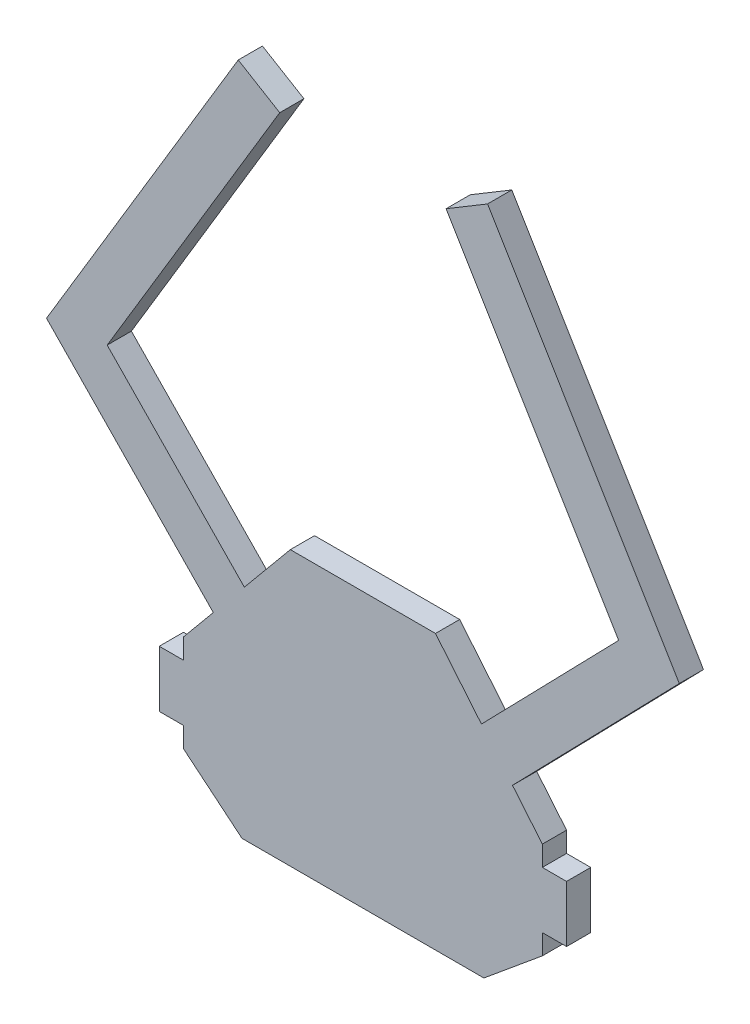
ISO-10303-21;
HEADER;
FILE_DESCRIPTION(('STEP AP214'),'2;1');
FILE_NAME('part.step','',(''),(''),'','','');
FILE_SCHEMA(('AUTOMOTIVE_DESIGN { 1 0 10303 214 1 1 1 1 }'));
ENDSEC;
DATA;
#1=APPLICATION_CONTEXT('core data for automotive mechanical design processes');
#2=APPLICATION_PROTOCOL_DEFINITION('international standard','automotive_design',2000,#1);
#3=PRODUCT_CONTEXT('',#1,'mechanical');
#4=PRODUCT('Part','Part','',(#3));
#5=PRODUCT_RELATED_PRODUCT_CATEGORY('part','',(#4));
#6=PRODUCT_DEFINITION_FORMATION('','',#4);
#7=PRODUCT_DEFINITION_CONTEXT('part definition',#1,'design');
#8=PRODUCT_DEFINITION('design','',#6,#7);
#9=PRODUCT_DEFINITION_SHAPE('','',#8);
#10=(LENGTH_UNIT() NAMED_UNIT(*) SI_UNIT(.MILLI.,.METRE.));
#11=(NAMED_UNIT(*) PLANE_ANGLE_UNIT() SI_UNIT($,.RADIAN.));
#12=(NAMED_UNIT(*) SI_UNIT($,.STERADIAN.) SOLID_ANGLE_UNIT());
#13=UNCERTAINTY_MEASURE_WITH_UNIT(LENGTH_MEASURE(1.E-05),#10,'distance_accuracy_value','');
#14=(GEOMETRIC_REPRESENTATION_CONTEXT(3) GLOBAL_UNCERTAINTY_ASSIGNED_CONTEXT((#13)) GLOBAL_UNIT_ASSIGNED_CONTEXT((#10,
#11,#12)) REPRESENTATION_CONTEXT('',''));
#15=CARTESIAN_POINT('',(0.,0.,0.));
#16=DIRECTION('',(0.,0.,1.));
#17=DIRECTION('',(1.,0.,0.));
#18=AXIS2_PLACEMENT_3D('',#15,#16,#17);
#19=CARTESIAN_POINT('',(16.145981173063,13.3708906589428,3.));
#20=DIRECTION('',(0.770190455771008,0.637813971185366,0.));
#21=DIRECTION('',(-0.637813971185366,0.770190455771008,0.));
#22=AXIS2_PLACEMENT_3D('',#19,#20,#21);
#23=PLANE('',#22);
#24=DIRECTION('',(0.637813971185366,-0.770190455771008,0.));
#25=VECTOR('',#24,1.);
#26=CARTESIAN_POINT('',(16.145981173063,13.3708906589428,3.));
#27=LINE('',#26,#25);
#28=CARTESIAN_POINT('',(9.,22.,3.));
#29=VERTEX_POINT('',#28);
#30=CARTESIAN_POINT('',(14.7001732919516,15.1167718738697,3.));
#31=VERTEX_POINT('',#30);
#32=EDGE_CURVE('E65',#29,#31,#27,.T.);
#33=ORIENTED_EDGE('',*,*,#32,.T.);
#34=DIRECTION('',(0.,0.,-1.));
#35=VECTOR('',#34,1.);
#36=CARTESIAN_POINT('',(14.7001732919516,15.1167718738697,3.));
#37=LINE('',#36,#35);
#38=CARTESIAN_POINT('',(14.7001732919516,15.1167718738697,0.));
#39=VERTEX_POINT('',#38);
#40=EDGE_CURVE('E319',#31,#39,#37,.T.);
#41=ORIENTED_EDGE('',*,*,#40,.T.);
#42=DIRECTION('',(0.637813971185366,-0.770190455771008,0.));
#43=VECTOR('',#42,1.);
#44=CARTESIAN_POINT('',(16.145981173063,13.3708906589428,0.));
#45=LINE('',#44,#43);
#46=CARTESIAN_POINT('',(9.,22.,0.));
#47=VERTEX_POINT('',#46);
#48=EDGE_CURVE('E430',#47,#39,#45,.T.);
#49=ORIENTED_EDGE('',*,*,#48,.F.);
#50=DIRECTION('',(0.,0.,-1.));
#51=VECTOR('',#50,1.);
#52=CARTESIAN_POINT('',(9.,22.,3.));
#53=LINE('',#52,#51);
#54=EDGE_CURVE('E488',#29,#47,#53,.T.);
#55=ORIENTED_EDGE('',*,*,#54,.F.);
#56=EDGE_LOOP('',(#33,#41,#49,#55));
#57=FACE_BOUND('',#56,.T.);
#58=ADVANCED_FACE('F41',(#57),#23,.T.);
#59=CARTESIAN_POINT('',(-16.145981173063,13.3708906589428,3.));
#60=DIRECTION('',(-0.770190455771008,0.637813971185366,0.));
#61=DIRECTION('',(-0.637813971185366,-0.770190455771008,0.));
#62=AXIS2_PLACEMENT_3D('',#59,#60,#61);
#63=PLANE('',#62);
#64=DIRECTION('',(0.637813971185366,0.770190455771008,0.));
#65=VECTOR('',#64,1.);
#66=CARTESIAN_POINT('',(-16.145981173063,13.3708906589428,0.));
#67=LINE('',#66,#65);
#68=CARTESIAN_POINT('',(-14.7001732919516,15.1167718738697,0.));
#69=VERTEX_POINT('',#68);
#70=CARTESIAN_POINT('',(-9.00000000000001,22.,0.));
#71=VERTEX_POINT('',#70);
#72=EDGE_CURVE('E438',#69,#71,#67,.T.);
#73=ORIENTED_EDGE('',*,*,#72,.F.);
#74=DIRECTION('',(0.,0.,1.));
#75=VECTOR('',#74,1.);
#76=CARTESIAN_POINT('',(-14.7001732919516,15.1167718738697,3.));
#77=LINE('',#76,#75);
#78=CARTESIAN_POINT('',(-14.7001732919516,15.1167718738697,3.));
#79=VERTEX_POINT('',#78);
#80=EDGE_CURVE('E342',#69,#79,#77,.T.);
#81=ORIENTED_EDGE('',*,*,#80,.T.);
#82=DIRECTION('',(0.637813971185366,0.770190455771008,0.));
#83=VECTOR('',#82,1.);
#84=CARTESIAN_POINT('',(-16.145981173063,13.3708906589428,3.));
#85=LINE('',#84,#83);
#86=CARTESIAN_POINT('',(-9.00000000000001,22.,3.));
#87=VERTEX_POINT('',#86);
#88=EDGE_CURVE('E385',#79,#87,#85,.T.);
#89=ORIENTED_EDGE('',*,*,#88,.T.);
#90=DIRECTION('',(0.,0.,-1.));
#91=VECTOR('',#90,1.);
#92=CARTESIAN_POINT('',(-9.00000000000001,22.,3.));
#93=LINE('',#92,#91);
#94=EDGE_CURVE('E484',#87,#71,#93,.T.);
#95=ORIENTED_EDGE('',*,*,#94,.T.);
#96=EDGE_LOOP('',(#73,#81,#89,#95));
#97=FACE_BOUND('',#96,.T.);
#98=ADVANCED_FACE('F583',(#97),#63,.T.);
#99=CARTESIAN_POINT('',(0.,-12.,3.));
#100=DIRECTION('',(0.,1.,0.));
#101=DIRECTION('',(-1.,0.,0.));
#102=AXIS2_PLACEMENT_3D('',#99,#100,#101);
#103=PLANE('',#102);
#104=DIRECTION('',(1.,0.,0.));
#105=VECTOR('',#104,1.);
#106=CARTESIAN_POINT('',(0.,-12.,0.));
#107=LINE('',#106,#105);
#108=CARTESIAN_POINT('',(-15.,-12.,0.));
#109=VERTEX_POINT('',#108);
#110=CARTESIAN_POINT('',(15.,-12.,0.));
#111=VERTEX_POINT('',#110);
#112=EDGE_CURVE('E353',#109,#111,#107,.T.);
#113=ORIENTED_EDGE('',*,*,#112,.T.);
#114=DIRECTION('',(0.,0.,-1.));
#115=VECTOR('',#114,1.);
#116=CARTESIAN_POINT('',(15.,-12.,3.));
#117=LINE('',#116,#115);
#118=CARTESIAN_POINT('',(15.,-12.,3.));
#119=VERTEX_POINT('',#118);
#120=EDGE_CURVE('E11',#119,#111,#117,.T.);
#121=ORIENTED_EDGE('',*,*,#120,.F.);
#122=DIRECTION('',(1.,0.,0.));
#123=VECTOR('',#122,1.);
#124=CARTESIAN_POINT('',(0.,-12.,3.));
#125=LINE('',#124,#123);
#126=CARTESIAN_POINT('',(-15.,-12.,3.));
#127=VERTEX_POINT('',#126);
#128=EDGE_CURVE('E354',#127,#119,#125,.T.);
#129=ORIENTED_EDGE('',*,*,#128,.F.);
#130=DIRECTION('',(0.,0.,-1.));
#131=VECTOR('',#130,1.);
#132=CARTESIAN_POINT('',(-15.,-12.,3.));
#133=LINE('',#132,#131);
#134=EDGE_CURVE('E405',#127,#109,#133,.T.);
#135=ORIENTED_EDGE('',*,*,#134,.T.);
#136=EDGE_LOOP('',(#113,#121,#129,#135));
#137=FACE_BOUND('',#136,.T.);
#138=ADVANCED_FACE('F43',(#137),#103,.F.);
#139=CARTESIAN_POINT('',(11.9915314043754,-14.4897671136203,3.));
#140=DIRECTION('',(-0.637567714034226,0.77039432112469,0.));
#141=DIRECTION('',(-0.77039432112469,-0.637567714034226,0.));
#142=AXIS2_PLACEMENT_3D('',#139,#140,#141);
#143=PLANE('',#142);
#144=DIRECTION('',(0.77039432112469,0.637567714034226,0.));
#145=VECTOR('',#144,1.);
#146=CARTESIAN_POINT('',(11.9915314043754,-14.4897671136203,0.));
#147=LINE('',#146,#145);
#148=CARTESIAN_POINT('',(22.25,-6.,0.));
#149=VERTEX_POINT('',#148);
#150=EDGE_CURVE('E409',#111,#149,#147,.T.);
#151=ORIENTED_EDGE('',*,*,#150,.T.);
#152=DIRECTION('',(0.,0.,-1.));
#153=VECTOR('',#152,1.);
#154=CARTESIAN_POINT('',(22.25,-6.,3.));
#155=LINE('',#154,#153);
#156=CARTESIAN_POINT('',(22.25,-6.,3.));
#157=VERTEX_POINT('',#156);
#158=EDGE_CURVE('E50',#157,#149,#155,.T.);
#159=ORIENTED_EDGE('',*,*,#158,.F.);
#160=DIRECTION('',(0.77039432112469,0.637567714034226,0.));
#161=VECTOR('',#160,1.);
#162=CARTESIAN_POINT('',(11.9915314043754,-14.4897671136203,3.));
#163=LINE('',#162,#161);
#164=EDGE_CURVE('E358',#119,#157,#163,.T.);
#165=ORIENTED_EDGE('',*,*,#164,.F.);
#166=ORIENTED_EDGE('',*,*,#120,.T.);
#167=EDGE_LOOP('',(#151,#159,#165,#166));
#168=FACE_BOUND('',#167,.T.);
#169=ADVANCED_FACE('F513',(#168),#143,.F.);
#170=CARTESIAN_POINT('',(22.25,0.,3.));
#171=DIRECTION('',(1.,0.,0.));
#172=DIRECTION('',(0.,0.,-1.));
#173=AXIS2_PLACEMENT_3D('',#170,#171,#172);
#174=PLANE('',#173);
#175=DIRECTION('',(0.,-1.,0.));
#176=VECTOR('',#175,1.);
#177=CARTESIAN_POINT('',(22.25,0.,0.));
#178=LINE('',#177,#176);
#179=CARTESIAN_POINT('',(22.25,-3.5,0.));
#180=VERTEX_POINT('',#179);
#181=EDGE_CURVE('E413',#180,#149,#178,.T.);
#182=ORIENTED_EDGE('',*,*,#181,.F.);
#183=DIRECTION('',(0.,0.,-1.));
#184=VECTOR('',#183,1.);
#185=CARTESIAN_POINT('',(22.25,-3.5,3.));
#186=LINE('',#185,#184);
#187=CARTESIAN_POINT('',(22.25,-3.5,3.));
#188=VERTEX_POINT('',#187);
#189=EDGE_CURVE('E504',#188,#180,#186,.T.);
#190=ORIENTED_EDGE('',*,*,#189,.F.);
#191=DIRECTION('',(0.,-1.,0.));
#192=VECTOR('',#191,1.);
#193=CARTESIAN_POINT('',(22.25,0.,3.));
#194=LINE('',#193,#192);
#195=EDGE_CURVE('E362',#188,#157,#194,.T.);
#196=ORIENTED_EDGE('',*,*,#195,.T.);
#197=ORIENTED_EDGE('',*,*,#158,.T.);
#198=EDGE_LOOP('',(#182,#190,#196,#197));
#199=FACE_BOUND('',#198,.T.);
#200=ADVANCED_FACE('F510',(#199),#174,.T.);
#201=CARTESIAN_POINT('',(0.,-3.5,3.));
#202=DIRECTION('',(0.,1.,0.));
#203=DIRECTION('',(0.,0.,1.));
#204=AXIS2_PLACEMENT_3D('',#201,#202,#203);
#205=PLANE('',#204);
#206=DIRECTION('',(1.,0.,0.));
#207=VECTOR('',#206,1.);
#208=CARTESIAN_POINT('',(0.,-3.5,0.));
#209=LINE('',#208,#207);
#210=CARTESIAN_POINT('',(25.25,-3.5,0.));
#211=VERTEX_POINT('',#210);
#212=EDGE_CURVE('E417',#180,#211,#209,.T.);
#213=ORIENTED_EDGE('',*,*,#212,.T.);
#214=DIRECTION('',(0.,0.,-1.));
#215=VECTOR('',#214,1.);
#216=CARTESIAN_POINT('',(25.25,-3.5,3.));
#217=LINE('',#216,#215);
#218=CARTESIAN_POINT('',(25.25,-3.5,3.));
#219=VERTEX_POINT('',#218);
#220=EDGE_CURVE('E501',#219,#211,#217,.T.);
#221=ORIENTED_EDGE('',*,*,#220,.F.);
#222=DIRECTION('',(1.,0.,0.));
#223=VECTOR('',#222,1.);
#224=CARTESIAN_POINT('',(0.,-3.5,3.));
#225=LINE('',#224,#223);
#226=EDGE_CURVE('E366',#188,#219,#225,.T.);
#227=ORIENTED_EDGE('',*,*,#226,.F.);
#228=ORIENTED_EDGE('',*,*,#189,.T.);
#229=EDGE_LOOP('',(#213,#221,#227,#228));
#230=FACE_BOUND('',#229,.T.);
#231=ADVANCED_FACE('F520',(#230),#205,.F.);
#232=CARTESIAN_POINT('',(25.25,0.,3.));
#233=DIRECTION('',(1.,0.,0.));
#234=DIRECTION('',(0.,0.,-1.));
#235=AXIS2_PLACEMENT_3D('',#232,#233,#234);
#236=PLANE('',#235);
#237=DIRECTION('',(0.,-1.,0.));
#238=VECTOR('',#237,1.);
#239=CARTESIAN_POINT('',(25.25,0.,0.));
#240=LINE('',#239,#238);
#241=CARTESIAN_POINT('',(25.25,3.5,0.));
#242=VERTEX_POINT('',#241);
#243=EDGE_CURVE('E422',#242,#211,#240,.T.);
#244=ORIENTED_EDGE('',*,*,#243,.F.);
#245=DIRECTION('',(0.,0.,-1.));
#246=VECTOR('',#245,1.);
#247=CARTESIAN_POINT('',(25.25,3.5,3.));
#248=LINE('',#247,#246);
#249=CARTESIAN_POINT('',(25.25,3.5,3.));
#250=VERTEX_POINT('',#249);
#251=EDGE_CURVE('E498',#250,#242,#248,.T.);
#252=ORIENTED_EDGE('',*,*,#251,.F.);
#253=DIRECTION('',(0.,-1.,0.));
#254=VECTOR('',#253,1.);
#255=CARTESIAN_POINT('',(25.25,0.,3.));
#256=LINE('',#255,#254);
#257=EDGE_CURVE('E370',#250,#219,#256,.T.);
#258=ORIENTED_EDGE('',*,*,#257,.T.);
#259=ORIENTED_EDGE('',*,*,#220,.T.);
#260=EDGE_LOOP('',(#244,#252,#258,#259));
#261=FACE_BOUND('',#260,.T.);
#262=ADVANCED_FACE('F555',(#261),#236,.T.);
#263=CARTESIAN_POINT('',(0.,3.5,3.));
#264=DIRECTION('',(0.,1.,0.));
#265=DIRECTION('',(0.,0.,1.));
#266=AXIS2_PLACEMENT_3D('',#263,#264,#265);
#267=PLANE('',#266);
#268=DIRECTION('',(1.,0.,0.));
#269=VECTOR('',#268,1.);
#270=CARTESIAN_POINT('',(0.,3.5,0.));
#271=LINE('',#270,#269);
#272=CARTESIAN_POINT('',(22.25,3.5,0.));
#273=VERTEX_POINT('',#272);
#274=EDGE_CURVE('E426',#273,#242,#271,.T.);
#275=ORIENTED_EDGE('',*,*,#274,.F.);
#276=DIRECTION('',(0.,0.,-1.));
#277=VECTOR('',#276,1.);
#278=CARTESIAN_POINT('',(22.25,3.5,3.));
#279=LINE('',#278,#277);
#280=CARTESIAN_POINT('',(22.25,3.5,3.));
#281=VERTEX_POINT('',#280);
#282=EDGE_CURVE('E495',#281,#273,#279,.T.);
#283=ORIENTED_EDGE('',*,*,#282,.F.);
#284=DIRECTION('',(1.,0.,0.));
#285=VECTOR('',#284,1.);
#286=CARTESIAN_POINT('',(0.,3.5,3.));
#287=LINE('',#286,#285);
#288=EDGE_CURVE('E374',#281,#250,#287,.T.);
#289=ORIENTED_EDGE('',*,*,#288,.T.);
#290=ORIENTED_EDGE('',*,*,#251,.T.);
#291=EDGE_LOOP('',(#275,#283,#289,#290));
#292=FACE_BOUND('',#291,.T.);
#293=ADVANCED_FACE('F553',(#292),#267,.T.);
#294=CARTESIAN_POINT('',(22.25,6.,0.));
#295=VERTEX_POINT('',#294);
#296=EDGE_CURVE('E418',#295,#273,#178,.T.);
#297=ORIENTED_EDGE('',*,*,#296,.F.);
#298=DIRECTION('',(0.,0.,-1.));
#299=VECTOR('',#298,1.);
#300=CARTESIAN_POINT('',(22.25,6.,3.));
#301=LINE('',#300,#299);
#302=CARTESIAN_POINT('',(22.25,6.,3.));
#303=VERTEX_POINT('',#302);
#304=EDGE_CURVE('E491',#303,#295,#301,.T.);
#305=ORIENTED_EDGE('',*,*,#304,.F.);
#306=EDGE_CURVE('E367',#303,#281,#194,.T.);
#307=ORIENTED_EDGE('',*,*,#306,.T.);
#308=ORIENTED_EDGE('',*,*,#282,.T.);
#309=EDGE_LOOP('',(#297,#305,#307,#308));
#310=FACE_BOUND('',#309,.T.);
#311=ADVANCED_FACE('F548',(#310),#174,.T.);
#312=DIRECTION('',(0.,0.,-1.));
#313=VECTOR('',#312,1.);
#314=CARTESIAN_POINT('',(18.549364667108,10.4686917227376,3.));
#315=LINE('',#314,#313);
#316=CARTESIAN_POINT('',(18.549364667108,10.4686917227376,3.));
#317=VERTEX_POINT('',#316);
#318=CARTESIAN_POINT('',(18.549364667108,10.4686917227376,0.));
#319=VERTEX_POINT('',#318);
#320=EDGE_CURVE('E349',#317,#319,#315,.T.);
#321=ORIENTED_EDGE('',*,*,#320,.F.);
#322=EDGE_CURVE('E381',#317,#303,#27,.T.);
#323=ORIENTED_EDGE('',*,*,#322,.T.);
#324=ORIENTED_EDGE('',*,*,#304,.T.);
#325=EDGE_CURVE('E434',#319,#295,#45,.T.);
#326=ORIENTED_EDGE('',*,*,#325,.F.);
#327=EDGE_LOOP('',(#321,#323,#324,#326));
#328=FACE_BOUND('',#327,.T.);
#329=ADVANCED_FACE('F560',(#328),#23,.T.);
#330=CARTESIAN_POINT('',(0.,22.,3.));
#331=DIRECTION('',(0.,1.,0.));
#332=DIRECTION('',(0.,0.,1.));
#333=AXIS2_PLACEMENT_3D('',#330,#331,#332);
#334=PLANE('',#333);
#335=DIRECTION('',(1.,0.,0.));
#336=VECTOR('',#335,1.);
#337=CARTESIAN_POINT('',(0.,22.,0.));
#338=LINE('',#337,#336);
#339=EDGE_CURVE('E433',#71,#47,#338,.T.);
#340=ORIENTED_EDGE('',*,*,#339,.F.);
#341=ORIENTED_EDGE('',*,*,#94,.F.);
#342=DIRECTION('',(1.,0.,0.));
#343=VECTOR('',#342,1.);
#344=CARTESIAN_POINT('',(0.,22.,3.));
#345=LINE('',#344,#343);
#346=EDGE_CURVE('E380',#87,#29,#345,.T.);
#347=ORIENTED_EDGE('',*,*,#346,.T.);
#348=ORIENTED_EDGE('',*,*,#54,.T.);
#349=EDGE_LOOP('',(#340,#341,#347,#348));
#350=FACE_BOUND('',#349,.T.);
#351=ADVANCED_FACE('F576',(#350),#334,.T.);
#352=DIRECTION('',(0.,0.,1.));
#353=VECTOR('',#352,1.);
#354=CARTESIAN_POINT('',(-18.549364667108,10.4686917227376,3.));
#355=LINE('',#354,#353);
#356=CARTESIAN_POINT('',(-18.549364667108,10.4686917227376,0.));
#357=VERTEX_POINT('',#356);
#358=CARTESIAN_POINT('',(-18.549364667108,10.4686917227376,3.));
#359=VERTEX_POINT('',#358);
#360=EDGE_CURVE('E346',#357,#359,#355,.T.);
#361=ORIENTED_EDGE('',*,*,#360,.F.);
#362=CARTESIAN_POINT('',(-22.25,6.,0.));
#363=VERTEX_POINT('',#362);
#364=EDGE_CURVE('E439',#363,#357,#67,.T.);
#365=ORIENTED_EDGE('',*,*,#364,.F.);
#366=DIRECTION('',(0.,0.,-1.));
#367=VECTOR('',#366,1.);
#368=CARTESIAN_POINT('',(-22.25,6.,3.));
#369=LINE('',#368,#367);
#370=CARTESIAN_POINT('',(-22.25,6.,3.));
#371=VERTEX_POINT('',#370);
#372=EDGE_CURVE('E481',#371,#363,#369,.T.);
#373=ORIENTED_EDGE('',*,*,#372,.F.);
#374=EDGE_CURVE('E57',#371,#359,#85,.T.);
#375=ORIENTED_EDGE('',*,*,#374,.T.);
#376=EDGE_LOOP('',(#361,#365,#373,#375));
#377=FACE_BOUND('',#376,.T.);
#378=ADVANCED_FACE('F621',(#377),#63,.T.);
#379=CARTESIAN_POINT('',(-22.25,0.,3.));
#380=DIRECTION('',(1.,0.,0.));
#381=DIRECTION('',(0.,1.,0.));
#382=AXIS2_PLACEMENT_3D('',#379,#380,#381);
#383=PLANE('',#382);
#384=DIRECTION('',(0.,-1.,0.));
#385=VECTOR('',#384,1.);
#386=CARTESIAN_POINT('',(-22.25,0.,0.));
#387=LINE('',#386,#385);
#388=CARTESIAN_POINT('',(-22.25,3.5,0.));
#389=VERTEX_POINT('',#388);
#390=EDGE_CURVE('E443',#363,#389,#387,.T.);
#391=ORIENTED_EDGE('',*,*,#390,.T.);
#392=DIRECTION('',(0.,0.,-1.));
#393=VECTOR('',#392,1.);
#394=CARTESIAN_POINT('',(-22.25,3.5,3.));
#395=LINE('',#394,#393);
#396=CARTESIAN_POINT('',(-22.25,3.5,3.));
#397=VERTEX_POINT('',#396);
#398=EDGE_CURVE('E477',#397,#389,#395,.T.);
#399=ORIENTED_EDGE('',*,*,#398,.F.);
#400=DIRECTION('',(0.,-1.,0.));
#401=VECTOR('',#400,1.);
#402=CARTESIAN_POINT('',(-22.25,0.,3.));
#403=LINE('',#402,#401);
#404=EDGE_CURVE('E388',#371,#397,#403,.T.);
#405=ORIENTED_EDGE('',*,*,#404,.F.);
#406=ORIENTED_EDGE('',*,*,#372,.T.);
#407=EDGE_LOOP('',(#391,#399,#405,#406));
#408=FACE_BOUND('',#407,.T.);
#409=ADVANCED_FACE('F608',(#408),#383,.F.);
#410=CARTESIAN_POINT('',(0.,3.5,3.));
#411=DIRECTION('',(0.,-1.,0.));
#412=DIRECTION('',(0.,0.,-1.));
#413=AXIS2_PLACEMENT_3D('',#410,#411,#412);
#414=PLANE('',#413);
#415=DIRECTION('',(-1.,0.,0.));
#416=VECTOR('',#415,1.);
#417=CARTESIAN_POINT('',(0.,3.5,0.));
#418=LINE('',#417,#416);
#419=CARTESIAN_POINT('',(-25.25,3.5,0.));
#420=VERTEX_POINT('',#419);
#421=EDGE_CURVE('E446',#389,#420,#418,.T.);
#422=ORIENTED_EDGE('',*,*,#421,.T.);
#423=DIRECTION('',(0.,0.,-1.));
#424=VECTOR('',#423,1.);
#425=CARTESIAN_POINT('',(-25.25,3.5,3.));
#426=LINE('',#425,#424);
#427=CARTESIAN_POINT('',(-25.25,3.5,3.));
#428=VERTEX_POINT('',#427);
#429=EDGE_CURVE('E473',#428,#420,#426,.T.);
#430=ORIENTED_EDGE('',*,*,#429,.F.);
#431=DIRECTION('',(-1.,0.,0.));
#432=VECTOR('',#431,1.);
#433=CARTESIAN_POINT('',(0.,3.5,3.));
#434=LINE('',#433,#432);
#435=EDGE_CURVE('E391',#397,#428,#434,.T.);
#436=ORIENTED_EDGE('',*,*,#435,.F.);
#437=ORIENTED_EDGE('',*,*,#398,.T.);
#438=EDGE_LOOP('',(#422,#430,#436,#437));
#439=FACE_BOUND('',#438,.T.);
#440=ADVANCED_FACE('F612',(#439),#414,.F.);
#441=CARTESIAN_POINT('',(-25.25,0.,3.));
#442=DIRECTION('',(1.,0.,0.));
#443=DIRECTION('',(0.,0.,-1.));
#444=AXIS2_PLACEMENT_3D('',#441,#442,#443);
#445=PLANE('',#444);
#446=DIRECTION('',(0.,-1.,0.));
#447=VECTOR('',#446,1.);
#448=CARTESIAN_POINT('',(-25.25,0.,0.));
#449=LINE('',#448,#447);
#450=CARTESIAN_POINT('',(-25.25,-3.5,0.));
#451=VERTEX_POINT('',#450);
#452=EDGE_CURVE('E450',#420,#451,#449,.T.);
#453=ORIENTED_EDGE('',*,*,#452,.T.);
#454=DIRECTION('',(0.,0.,-1.));
#455=VECTOR('',#454,1.);
#456=CARTESIAN_POINT('',(-25.25,-3.5,3.));
#457=LINE('',#456,#455);
#458=CARTESIAN_POINT('',(-25.25,-3.5,3.));
#459=VERTEX_POINT('',#458);
#460=EDGE_CURVE('E470',#459,#451,#457,.T.);
#461=ORIENTED_EDGE('',*,*,#460,.F.);
#462=DIRECTION('',(0.,-1.,0.));
#463=VECTOR('',#462,1.);
#464=CARTESIAN_POINT('',(-25.25,0.,3.));
#465=LINE('',#464,#463);
#466=EDGE_CURVE('E395',#428,#459,#465,.T.);
#467=ORIENTED_EDGE('',*,*,#466,.F.);
#468=ORIENTED_EDGE('',*,*,#429,.T.);
#469=EDGE_LOOP('',(#453,#461,#467,#468));
#470=FACE_BOUND('',#469,.T.);
#471=ADVANCED_FACE('F617',(#470),#445,.F.);
#472=CARTESIAN_POINT('',(0.,-3.5,3.));
#473=DIRECTION('',(0.,-1.,0.));
#474=DIRECTION('',(0.,0.,-1.));
#475=AXIS2_PLACEMENT_3D('',#472,#473,#474);
#476=PLANE('',#475);
#477=DIRECTION('',(-1.,0.,0.));
#478=VECTOR('',#477,1.);
#479=CARTESIAN_POINT('',(0.,-3.5,0.));
#480=LINE('',#479,#478);
#481=CARTESIAN_POINT('',(-22.25,-3.5,0.));
#482=VERTEX_POINT('',#481);
#483=EDGE_CURVE('E454',#482,#451,#480,.T.);
#484=ORIENTED_EDGE('',*,*,#483,.F.);
#485=DIRECTION('',(0.,0.,-1.));
#486=VECTOR('',#485,1.);
#487=CARTESIAN_POINT('',(-22.25,-3.5,3.));
#488=LINE('',#487,#486);
#489=CARTESIAN_POINT('',(-22.25,-3.5,3.));
#490=VERTEX_POINT('',#489);
#491=EDGE_CURVE('E467',#490,#482,#488,.T.);
#492=ORIENTED_EDGE('',*,*,#491,.F.);
#493=DIRECTION('',(-1.,0.,0.));
#494=VECTOR('',#493,1.);
#495=CARTESIAN_POINT('',(0.,-3.5,3.));
#496=LINE('',#495,#494);
#497=EDGE_CURVE('E398',#490,#459,#496,.T.);
#498=ORIENTED_EDGE('',*,*,#497,.T.);
#499=ORIENTED_EDGE('',*,*,#460,.T.);
#500=EDGE_LOOP('',(#484,#492,#498,#499));
#501=FACE_BOUND('',#500,.T.);
#502=ADVANCED_FACE('F619',(#501),#476,.T.);
#503=CARTESIAN_POINT('',(-22.25,-6.,0.));
#504=VERTEX_POINT('',#503);
#505=EDGE_CURVE('E447',#482,#504,#387,.T.);
#506=ORIENTED_EDGE('',*,*,#505,.T.);
#507=DIRECTION('',(0.,0.,-1.));
#508=VECTOR('',#507,1.);
#509=CARTESIAN_POINT('',(-22.25,-6.,3.));
#510=LINE('',#509,#508);
#511=CARTESIAN_POINT('',(-22.25,-6.,3.));
#512=VERTEX_POINT('',#511);
#513=EDGE_CURVE('E463',#512,#504,#510,.T.);
#514=ORIENTED_EDGE('',*,*,#513,.F.);
#515=EDGE_CURVE('E392',#490,#512,#403,.T.);
#516=ORIENTED_EDGE('',*,*,#515,.F.);
#517=ORIENTED_EDGE('',*,*,#491,.T.);
#518=EDGE_LOOP('',(#506,#514,#516,#517));
#519=FACE_BOUND('',#518,.T.);
#520=ADVANCED_FACE('F537',(#519),#383,.F.);
#521=CARTESIAN_POINT('',(-11.9915314043754,-14.4897671136203,3.));
#522=DIRECTION('',(0.637567714034226,0.770394321124689,0.));
#523=DIRECTION('',(-0.77039432112469,0.637567714034226,0.));
#524=AXIS2_PLACEMENT_3D('',#521,#522,#523);
#525=PLANE('',#524);
#526=DIRECTION('',(0.77039432112469,-0.637567714034226,0.));
#527=VECTOR('',#526,1.);
#528=CARTESIAN_POINT('',(-11.9915314043754,-14.4897671136203,0.));
#529=LINE('',#528,#527);
#530=EDGE_CURVE('E359',#504,#109,#529,.T.);
#531=ORIENTED_EDGE('',*,*,#530,.T.);
#532=ORIENTED_EDGE('',*,*,#134,.F.);
#533=DIRECTION('',(0.77039432112469,-0.637567714034226,0.));
#534=VECTOR('',#533,1.);
#535=CARTESIAN_POINT('',(-11.9915314043754,-14.4897671136203,3.));
#536=LINE('',#535,#534);
#537=EDGE_CURVE('E402',#512,#127,#536,.T.);
#538=ORIENTED_EDGE('',*,*,#537,.F.);
#539=ORIENTED_EDGE('',*,*,#513,.T.);
#540=EDGE_LOOP('',(#531,#532,#538,#539));
#541=FACE_BOUND('',#540,.T.);
#542=ADVANCED_FACE('F533',(#541),#525,.F.);
#543=CARTESIAN_POINT('',(0.,0.,3.));
#544=DIRECTION('',(0.,0.,1.));
#545=DIRECTION('',(1.,0.,0.));
#546=AXIS2_PLACEMENT_3D('',#543,#544,#545);
#547=PLANE('',#546);
#548=ORIENTED_EDGE('',*,*,#322,.F.);
#549=DIRECTION('',(0.697159130758357,0.71691641521188,0.));
#550=VECTOR('',#549,1.);
#551=CARTESIAN_POINT('',(4.30149849127128,-4.18295478455014,3.));
#552=LINE('',#551,#550);
#553=CARTESIAN_POINT('',(39.2293669745271,31.7347592053238,3.));
#554=VERTEX_POINT('',#553);
#555=EDGE_CURVE('E258',#317,#554,#552,.T.);
#556=ORIENTED_EDGE('',*,*,#555,.T.);
#557=DIRECTION('',(-0.514512373955714,0.857482954376619,0.));
#558=VECTOR('',#557,1.);
#559=CARTESIAN_POINT('',(36.8535276758572,35.6943174279661,3.));
#560=LINE('',#559,#558);
#561=CARTESIAN_POINT('',(15.4583131447429,71.3514419099529,3.));
#562=VERTEX_POINT('',#561);
#563=EDGE_CURVE('E289',#554,#562,#560,.T.);
#564=ORIENTED_EDGE('',*,*,#563,.T.);
#565=DIRECTION('',(0.857482954376618,0.514512373955716,0.));
#566=VECTOR('',#565,1.);
#567=CARTESIAN_POINT('',(10.3134154184832,68.2643676662186,3.));
#568=LINE('',#567,#566);
#569=CARTESIAN_POINT('',(10.3134154184832,68.2643676662186,3.));
#570=VERTEX_POINT('',#569);
#571=EDGE_CURVE('E245',#570,#562,#568,.T.);
#572=ORIENTED_EDGE('',*,*,#571,.F.);
#573=DIRECTION('',(-0.514512373955714,0.857482954376619,0.));
#574=VECTOR('',#573,1.);
#575=CARTESIAN_POINT('',(31.7086299495975,32.6072431842319,3.));
#576=LINE('',#575,#574);
#577=CARTESIAN_POINT('',(31.7086299495975,32.6072431842319,3.));
#578=VERTEX_POINT('',#577);
#579=EDGE_CURVE('E294',#578,#570,#576,.T.);
#580=ORIENTED_EDGE('',*,*,#579,.F.);
#581=DIRECTION('',(0.697159130758357,0.71691641521188,0.));
#582=VECTOR('',#581,1.);
#583=CARTESIAN_POINT('',(0.,0.,3.));
#584=LINE('',#583,#582);
#585=EDGE_CURVE('E297',#31,#578,#584,.T.);
#586=ORIENTED_EDGE('',*,*,#585,.F.);
#587=ORIENTED_EDGE('',*,*,#32,.F.);
#588=ORIENTED_EDGE('',*,*,#346,.F.);
#589=ORIENTED_EDGE('',*,*,#88,.F.);
#590=DIRECTION('',(0.697159130758357,-0.71691641521188,0.));
#591=VECTOR('',#590,1.);
#592=CARTESIAN_POINT('',(0.,0.,3.));
#593=LINE('',#592,#591);
#594=CARTESIAN_POINT('',(-31.7086299495975,32.6072431842319,3.));
#595=VERTEX_POINT('',#594);
#596=EDGE_CURVE('E300',#595,#79,#593,.T.);
#597=ORIENTED_EDGE('',*,*,#596,.F.);
#598=DIRECTION('',(-0.514512373955715,-0.857482954376619,0.));
#599=VECTOR('',#598,1.);
#600=CARTESIAN_POINT('',(-31.7086299495975,32.6072431842319,3.));
#601=LINE('',#600,#599);
#602=CARTESIAN_POINT('',(-10.3134154184832,68.2643676662186,3.));
#603=VERTEX_POINT('',#602);
#604=EDGE_CURVE('E304',#603,#595,#601,.T.);
#605=ORIENTED_EDGE('',*,*,#604,.F.);
#606=DIRECTION('',(0.857482954376619,-0.514512373955715,0.));
#607=VECTOR('',#606,1.);
#608=CARTESIAN_POINT('',(-15.4583131447429,71.3514419099529,3.));
#609=LINE('',#608,#607);
#610=CARTESIAN_POINT('',(-15.4583131447429,71.3514419099529,3.));
#611=VERTEX_POINT('',#610);
#612=EDGE_CURVE('E307',#611,#603,#609,.T.);
#613=ORIENTED_EDGE('',*,*,#612,.F.);
#614=DIRECTION('',(-0.514512373955715,-0.857482954376619,0.));
#615=VECTOR('',#614,1.);
#616=CARTESIAN_POINT('',(-36.8535276758572,35.6943174279662,3.));
#617=LINE('',#616,#615);
#618=CARTESIAN_POINT('',(-39.2293669745271,31.7347592053238,3.));
#619=VERTEX_POINT('',#618);
#620=EDGE_CURVE('E310',#611,#619,#617,.T.);
#621=ORIENTED_EDGE('',*,*,#620,.T.);
#622=DIRECTION('',(0.697159130758357,-0.71691641521188,0.));
#623=VECTOR('',#622,1.);
#624=CARTESIAN_POINT('',(-4.30149849127128,-4.18295478455014,3.));
#625=LINE('',#624,#623);
#626=EDGE_CURVE('E261',#619,#359,#625,.T.);
#627=ORIENTED_EDGE('',*,*,#626,.T.);
#628=ORIENTED_EDGE('',*,*,#374,.F.);
#629=ORIENTED_EDGE('',*,*,#404,.T.);
#630=ORIENTED_EDGE('',*,*,#435,.T.);
#631=ORIENTED_EDGE('',*,*,#466,.T.);
#632=ORIENTED_EDGE('',*,*,#497,.F.);
#633=ORIENTED_EDGE('',*,*,#515,.T.);
#634=ORIENTED_EDGE('',*,*,#537,.T.);
#635=ORIENTED_EDGE('',*,*,#128,.T.);
#636=ORIENTED_EDGE('',*,*,#164,.T.);
#637=ORIENTED_EDGE('',*,*,#195,.F.);
#638=ORIENTED_EDGE('',*,*,#226,.T.);
#639=ORIENTED_EDGE('',*,*,#257,.F.);
#640=ORIENTED_EDGE('',*,*,#288,.F.);
#641=ORIENTED_EDGE('',*,*,#306,.F.);
#642=EDGE_LOOP('',(#548,#556,#564,#572,#580,#586,#587,#588,#589,#597,#605,#613,#621,#627,#628,
#629,#630,#631,#632,#633,#634,#635,#636,#637,#638,#639,#640,#641));
#643=FACE_BOUND('',#642,.T.);
#644=ADVANCED_FACE('F524',(#643),#547,.T.);
#645=CARTESIAN_POINT('',(0.,0.,0.));
#646=DIRECTION('',(0.,0.,1.));
#647=DIRECTION('',(1.,0.,0.));
#648=AXIS2_PLACEMENT_3D('',#645,#646,#647);
#649=PLANE('',#648);
#650=ORIENTED_EDGE('',*,*,#48,.T.);
#651=DIRECTION('',(0.697159130758357,0.71691641521188,0.));
#652=VECTOR('',#651,1.);
#653=CARTESIAN_POINT('',(0.,0.,0.));
#654=LINE('',#653,#652);
#655=CARTESIAN_POINT('',(31.7086299495975,32.6072431842319,0.));
#656=VERTEX_POINT('',#655);
#657=EDGE_CURVE('E266',#39,#656,#654,.T.);
#658=ORIENTED_EDGE('',*,*,#657,.T.);
#659=DIRECTION('',(-0.514512373955714,0.857482954376619,0.));
#660=VECTOR('',#659,1.);
#661=CARTESIAN_POINT('',(31.7086299495975,32.6072431842319,0.));
#662=LINE('',#661,#660);
#663=CARTESIAN_POINT('',(10.3134154184832,68.2643676662186,0.));
#664=VERTEX_POINT('',#663);
#665=EDGE_CURVE('E235',#656,#664,#662,.T.);
#666=ORIENTED_EDGE('',*,*,#665,.T.);
#667=DIRECTION('',(0.857482954376618,0.514512373955716,0.));
#668=VECTOR('',#667,1.);
#669=CARTESIAN_POINT('',(10.3134154184832,68.2643676662186,0.));
#670=LINE('',#669,#668);
#671=CARTESIAN_POINT('',(15.4583131447429,71.3514419099529,0.));
#672=VERTEX_POINT('',#671);
#673=EDGE_CURVE('E227',#664,#672,#670,.T.);
#674=ORIENTED_EDGE('',*,*,#673,.T.);
#675=DIRECTION('',(-0.514512373955714,0.857482954376619,0.));
#676=VECTOR('',#675,1.);
#677=CARTESIAN_POINT('',(36.8535276758572,35.6943174279661,0.));
#678=LINE('',#677,#676);
#679=CARTESIAN_POINT('',(39.2293669745271,31.7347592053238,0.));
#680=VERTEX_POINT('',#679);
#681=EDGE_CURVE('E233',#680,#672,#678,.T.);
#682=ORIENTED_EDGE('',*,*,#681,.F.);
#683=DIRECTION('',(0.697159130758357,0.71691641521188,0.));
#684=VECTOR('',#683,1.);
#685=CARTESIAN_POINT('',(4.30149849127128,-4.18295478455014,0.));
#686=LINE('',#685,#684);
#687=EDGE_CURVE('E251',#319,#680,#686,.T.);
#688=ORIENTED_EDGE('',*,*,#687,.F.);
#689=ORIENTED_EDGE('',*,*,#325,.T.);
#690=ORIENTED_EDGE('',*,*,#296,.T.);
#691=ORIENTED_EDGE('',*,*,#274,.T.);
#692=ORIENTED_EDGE('',*,*,#243,.T.);
#693=ORIENTED_EDGE('',*,*,#212,.F.);
#694=ORIENTED_EDGE('',*,*,#181,.T.);
#695=ORIENTED_EDGE('',*,*,#150,.F.);
#696=ORIENTED_EDGE('',*,*,#112,.F.);
#697=ORIENTED_EDGE('',*,*,#530,.F.);
#698=ORIENTED_EDGE('',*,*,#505,.F.);
#699=ORIENTED_EDGE('',*,*,#483,.T.);
#700=ORIENTED_EDGE('',*,*,#452,.F.);
#701=ORIENTED_EDGE('',*,*,#421,.F.);
#702=ORIENTED_EDGE('',*,*,#390,.F.);
#703=ORIENTED_EDGE('',*,*,#364,.T.);
#704=DIRECTION('',(0.697159130758357,-0.71691641521188,0.));
#705=VECTOR('',#704,1.);
#706=CARTESIAN_POINT('',(-4.30149849127128,-4.18295478455014,0.));
#707=LINE('',#706,#705);
#708=CARTESIAN_POINT('',(-39.2293669745271,31.7347592053238,0.));
#709=VERTEX_POINT('',#708);
#710=EDGE_CURVE('E283',#709,#357,#707,.T.);
#711=ORIENTED_EDGE('',*,*,#710,.F.);
#712=DIRECTION('',(-0.514512373955715,-0.857482954376619,0.));
#713=VECTOR('',#712,1.);
#714=CARTESIAN_POINT('',(-36.8535276758572,35.6943174279662,0.));
#715=LINE('',#714,#713);
#716=CARTESIAN_POINT('',(-15.4583131447429,71.3514419099529,0.));
#717=VERTEX_POINT('',#716);
#718=EDGE_CURVE('E279',#717,#709,#715,.T.);
#719=ORIENTED_EDGE('',*,*,#718,.F.);
#720=DIRECTION('',(0.857482954376619,-0.514512373955715,0.));
#721=VECTOR('',#720,1.);
#722=CARTESIAN_POINT('',(-15.4583131447429,71.3514419099529,0.));
#723=LINE('',#722,#721);
#724=CARTESIAN_POINT('',(-10.3134154184832,68.2643676662186,0.));
#725=VERTEX_POINT('',#724);
#726=EDGE_CURVE('E276',#717,#725,#723,.T.);
#727=ORIENTED_EDGE('',*,*,#726,.T.);
#728=DIRECTION('',(-0.514512373955715,-0.857482954376619,0.));
#729=VECTOR('',#728,1.);
#730=CARTESIAN_POINT('',(-31.7086299495975,32.6072431842319,0.));
#731=LINE('',#730,#729);
#732=CARTESIAN_POINT('',(-31.7086299495975,32.6072431842319,0.));
#733=VERTEX_POINT('',#732);
#734=EDGE_CURVE('E273',#725,#733,#731,.T.);
#735=ORIENTED_EDGE('',*,*,#734,.T.);
#736=DIRECTION('',(0.697159130758357,-0.71691641521188,0.));
#737=VECTOR('',#736,1.);
#738=CARTESIAN_POINT('',(0.,0.,0.));
#739=LINE('',#738,#737);
#740=EDGE_CURVE('E269',#733,#69,#739,.T.);
#741=ORIENTED_EDGE('',*,*,#740,.T.);
#742=ORIENTED_EDGE('',*,*,#72,.T.);
#743=ORIENTED_EDGE('',*,*,#339,.T.);
#744=EDGE_LOOP('',(#650,#658,#666,#674,#682,#688,#689,#690,#691,#692,#693,#694,#695,#696,#697,
#698,#699,#700,#701,#702,#703,#711,#719,#727,#735,#741,#742,#743));
#745=FACE_BOUND('',#744,.T.);
#746=ADVANCED_FACE('F230',(#745),#649,.F.);
#747=CARTESIAN_POINT('',(-36.8535276758572,35.6943174279662,0.));
#748=DIRECTION('',(-0.857482954376619,0.514512373955715,0.));
#749=DIRECTION('',(-0.514512373955715,-0.857482954376619,0.));
#750=AXIS2_PLACEMENT_3D('',#747,#748,#749);
#751=PLANE('',#750);
#752=ORIENTED_EDGE('',*,*,#620,.F.);
#753=DIRECTION('',(0.,0.,1.));
#754=VECTOR('',#753,1.);
#755=CARTESIAN_POINT('',(-15.4583131447429,71.3514419099529,0.));
#756=LINE('',#755,#754);
#757=EDGE_CURVE('E323',#717,#611,#756,.T.);
#758=ORIENTED_EDGE('',*,*,#757,.F.);
#759=ORIENTED_EDGE('',*,*,#718,.T.);
#760=DIRECTION('',(0.,0.,1.));
#761=VECTOR('',#760,1.);
#762=CARTESIAN_POINT('',(-39.2293669745271,31.7347592053238,0.));
#763=LINE('',#762,#761);
#764=EDGE_CURVE('E320',#709,#619,#763,.T.);
#765=ORIENTED_EDGE('',*,*,#764,.T.);
#766=EDGE_LOOP('',(#752,#758,#759,#765));
#767=FACE_BOUND('',#766,.T.);
#768=ADVANCED_FACE('F596',(#767),#751,.T.);
#769=CARTESIAN_POINT('',(-15.4583131447429,71.3514419099529,0.));
#770=DIRECTION('',(-0.514512373955715,-0.857482954376619,0.));
#771=DIRECTION('',(0.857482954376619,-0.514512373955715,0.));
#772=AXIS2_PLACEMENT_3D('',#769,#770,#771);
#773=PLANE('',#772);
#774=ORIENTED_EDGE('',*,*,#612,.T.);
#775=DIRECTION('',(0.,0.,1.));
#776=VECTOR('',#775,1.);
#777=CARTESIAN_POINT('',(-10.3134154184832,68.2643676662186,0.));
#778=LINE('',#777,#776);
#779=EDGE_CURVE('E326',#725,#603,#778,.T.);
#780=ORIENTED_EDGE('',*,*,#779,.F.);
#781=ORIENTED_EDGE('',*,*,#726,.F.);
#782=ORIENTED_EDGE('',*,*,#757,.T.);
#783=EDGE_LOOP('',(#774,#780,#781,#782));
#784=FACE_BOUND('',#783,.T.);
#785=ADVANCED_FACE('F754',(#784),#773,.F.);
#786=CARTESIAN_POINT('',(-31.7086299495975,32.6072431842319,0.));
#787=DIRECTION('',(-0.857482954376619,0.514512373955715,0.));
#788=DIRECTION('',(-0.514512373955715,-0.857482954376619,0.));
#789=AXIS2_PLACEMENT_3D('',#786,#787,#788);
#790=PLANE('',#789);
#791=ORIENTED_EDGE('',*,*,#604,.T.);
#792=DIRECTION('',(0.,0.,1.));
#793=VECTOR('',#792,1.);
#794=CARTESIAN_POINT('',(-31.7086299495975,32.6072431842319,0.));
#795=LINE('',#794,#793);
#796=EDGE_CURVE('E330',#733,#595,#795,.T.);
#797=ORIENTED_EDGE('',*,*,#796,.F.);
#798=ORIENTED_EDGE('',*,*,#734,.F.);
#799=ORIENTED_EDGE('',*,*,#779,.T.);
#800=EDGE_LOOP('',(#791,#797,#798,#799));
#801=FACE_BOUND('',#800,.T.);
#802=ADVANCED_FACE('F590',(#801),#790,.F.);
#803=CARTESIAN_POINT('',(0.,0.,0.));
#804=DIRECTION('',(-0.71691641521188,-0.697159130758357,0.));
#805=DIRECTION('',(0.697159130758357,-0.71691641521188,0.));
#806=AXIS2_PLACEMENT_3D('',#803,#804,#805);
#807=PLANE('',#806);
#808=ORIENTED_EDGE('',*,*,#80,.F.);
#809=ORIENTED_EDGE('',*,*,#740,.F.);
#810=ORIENTED_EDGE('',*,*,#796,.T.);
#811=ORIENTED_EDGE('',*,*,#596,.T.);
#812=EDGE_LOOP('',(#808,#809,#810,#811));
#813=FACE_BOUND('',#812,.T.);
#814=ADVANCED_FACE('F586',(#813),#807,.F.);
#815=CARTESIAN_POINT('',(-4.30149849127128,-4.18295478455014,0.));
#816=DIRECTION('',(-0.71691641521188,-0.697159130758357,0.));
#817=DIRECTION('',(0.697159130758357,-0.71691641521188,0.));
#818=AXIS2_PLACEMENT_3D('',#815,#816,#817);
#819=PLANE('',#818);
#820=ORIENTED_EDGE('',*,*,#710,.T.);
#821=ORIENTED_EDGE('',*,*,#360,.T.);
#822=ORIENTED_EDGE('',*,*,#626,.F.);
#823=ORIENTED_EDGE('',*,*,#764,.F.);
#824=EDGE_LOOP('',(#820,#821,#822,#823));
#825=FACE_BOUND('',#824,.T.);
#826=ADVANCED_FACE('F602',(#825),#819,.T.);
#827=CARTESIAN_POINT('',(36.8535276758572,35.6943174279661,0.));
#828=DIRECTION('',(0.857482954376619,0.514512373955714,0.));
#829=DIRECTION('',(-0.514512373955714,0.857482954376619,0.));
#830=AXIS2_PLACEMENT_3D('',#827,#828,#829);
#831=PLANE('',#830);
#832=ORIENTED_EDGE('',*,*,#563,.F.);
#833=DIRECTION('',(0.,0.,1.));
#834=VECTOR('',#833,1.);
#835=CARTESIAN_POINT('',(39.2293669745271,31.7347592053238,0.));
#836=LINE('',#835,#834);
#837=EDGE_CURVE('E256',#680,#554,#836,.T.);
#838=ORIENTED_EDGE('',*,*,#837,.F.);
#839=ORIENTED_EDGE('',*,*,#681,.T.);
#840=DIRECTION('',(0.,0.,1.));
#841=VECTOR('',#840,1.);
#842=CARTESIAN_POINT('',(15.4583131447429,71.3514419099529,0.));
#843=LINE('',#842,#841);
#844=EDGE_CURVE('E242',#672,#562,#843,.T.);
#845=ORIENTED_EDGE('',*,*,#844,.T.);
#846=EDGE_LOOP('',(#832,#838,#839,#845));
#847=FACE_BOUND('',#846,.T.);
#848=ADVANCED_FACE('F254',(#847),#831,.T.);
#849=CARTESIAN_POINT('',(4.30149849127128,-4.18295478455014,0.));
#850=DIRECTION('',(0.71691641521188,-0.697159130758357,0.));
#851=DIRECTION('',(0.697159130758357,0.71691641521188,0.));
#852=AXIS2_PLACEMENT_3D('',#849,#850,#851);
#853=PLANE('',#852);
#854=ORIENTED_EDGE('',*,*,#555,.F.);
#855=ORIENTED_EDGE('',*,*,#320,.T.);
#856=ORIENTED_EDGE('',*,*,#687,.T.);
#857=ORIENTED_EDGE('',*,*,#837,.T.);
#858=EDGE_LOOP('',(#854,#855,#856,#857));
#859=FACE_BOUND('',#858,.T.);
#860=ADVANCED_FACE('F563',(#859),#853,.T.);
#861=CARTESIAN_POINT('',(0.,0.,0.));
#862=DIRECTION('',(0.71691641521188,-0.697159130758357,0.));
#863=DIRECTION('',(0.697159130758357,0.71691641521188,0.));
#864=AXIS2_PLACEMENT_3D('',#861,#862,#863);
#865=PLANE('',#864);
#866=ORIENTED_EDGE('',*,*,#40,.F.);
#867=ORIENTED_EDGE('',*,*,#585,.T.);
#868=DIRECTION('',(0.,0.,1.));
#869=VECTOR('',#868,1.);
#870=CARTESIAN_POINT('',(31.7086299495975,32.6072431842319,0.));
#871=LINE('',#870,#869);
#872=EDGE_CURVE('E334',#656,#578,#871,.T.);
#873=ORIENTED_EDGE('',*,*,#872,.F.);
#874=ORIENTED_EDGE('',*,*,#657,.F.);
#875=EDGE_LOOP('',(#866,#867,#873,#874));
#876=FACE_BOUND('',#875,.T.);
#877=ADVANCED_FACE('F571',(#876),#865,.F.);
#878=CARTESIAN_POINT('',(31.7086299495975,32.6072431842319,0.));
#879=DIRECTION('',(0.857482954376619,0.514512373955714,0.));
#880=DIRECTION('',(-0.514512373955714,0.857482954376619,0.));
#881=AXIS2_PLACEMENT_3D('',#878,#879,#880);
#882=PLANE('',#881);
#883=ORIENTED_EDGE('',*,*,#579,.T.);
#884=DIRECTION('',(0.,0.,1.));
#885=VECTOR('',#884,1.);
#886=CARTESIAN_POINT('',(10.3134154184832,68.2643676662186,0.));
#887=LINE('',#886,#885);
#888=EDGE_CURVE('E250',#664,#570,#887,.T.);
#889=ORIENTED_EDGE('',*,*,#888,.F.);
#890=ORIENTED_EDGE('',*,*,#665,.F.);
#891=ORIENTED_EDGE('',*,*,#872,.T.);
#892=EDGE_LOOP('',(#883,#889,#890,#891));
#893=FACE_BOUND('',#892,.T.);
#894=ADVANCED_FACE('F567',(#893),#882,.F.);
#895=CARTESIAN_POINT('',(10.3134154184832,68.2643676662186,0.));
#896=DIRECTION('',(0.514512373955715,-0.857482954376618,0.));
#897=DIRECTION('',(0.857482954376619,0.514512373955716,0.));
#898=AXIS2_PLACEMENT_3D('',#895,#896,#897);
#899=PLANE('',#898);
#900=ORIENTED_EDGE('',*,*,#571,.T.);
#901=ORIENTED_EDGE('',*,*,#844,.F.);
#902=ORIENTED_EDGE('',*,*,#673,.F.);
#903=ORIENTED_EDGE('',*,*,#888,.T.);
#904=EDGE_LOOP('',(#900,#901,#902,#903));
#905=FACE_BOUND('',#904,.T.);
#906=ADVANCED_FACE('F243',(#905),#899,.F.);
#907=CLOSED_SHELL('',(#58,#98,#138,#169,#200,#231,#262,#293,#311,#329,#351,#378,#409,#440,#471,
#502,#520,#542,#644,#746,#768,#785,#802,#814,#826,#848,#860,#877,#894,#906));
#908=MANIFOLD_SOLID_BREP('B2',#907);
#909=ADVANCED_BREP_SHAPE_REPRESENTATION('',(#18,#908),#14);
#910=SHAPE_DEFINITION_REPRESENTATION(#9,#909);
ENDSEC;
END-ISO-10303-21;
